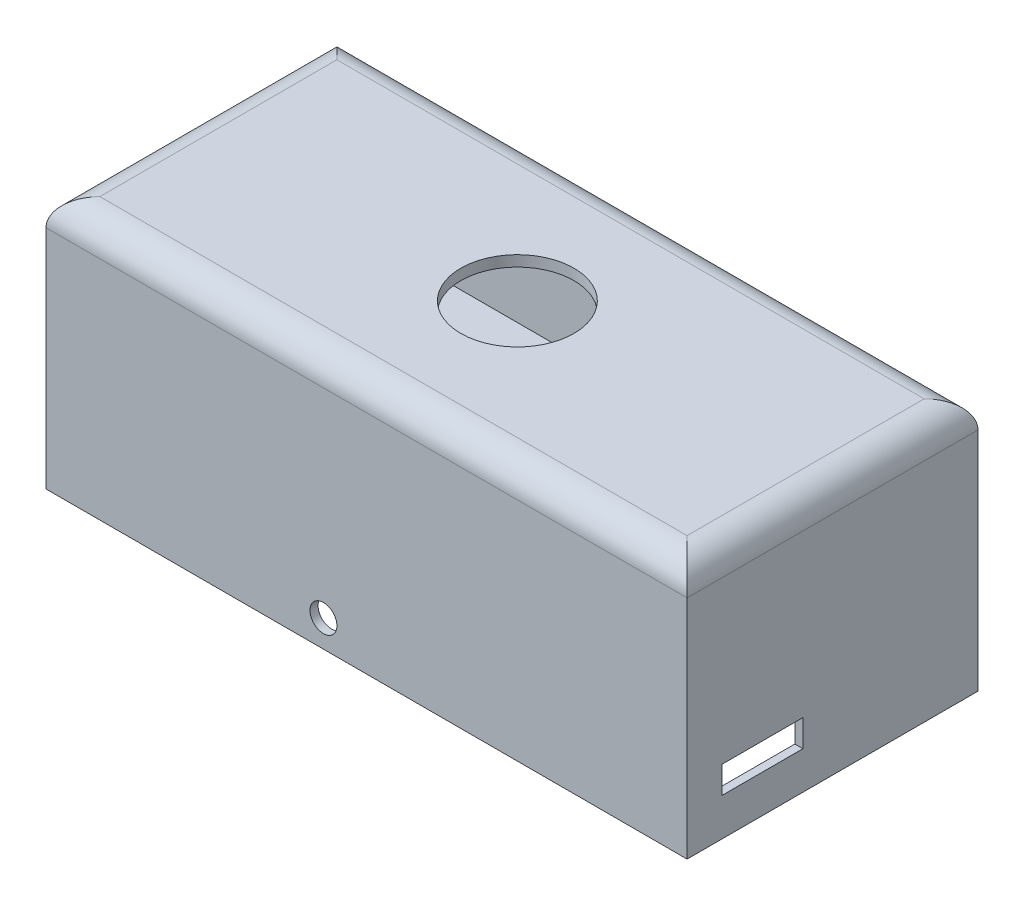
ISO-10303-21;
HEADER;
FILE_DESCRIPTION(('STEP AP214'),'2;1');
FILE_NAME('part.step','',(''),(''),'','','');
FILE_SCHEMA(('AUTOMOTIVE_DESIGN { 1 0 10303 214 1 1 1 1 }'));
ENDSEC;
DATA;
#1=APPLICATION_CONTEXT('core data for automotive mechanical design processes');
#2=APPLICATION_PROTOCOL_DEFINITION('international standard','automotive_design',2000,#1);
#3=PRODUCT_CONTEXT('',#1,'mechanical');
#4=PRODUCT('Part','Part','',(#3));
#5=PRODUCT_RELATED_PRODUCT_CATEGORY('part','',(#4));
#6=PRODUCT_DEFINITION_FORMATION('','',#4);
#7=PRODUCT_DEFINITION_CONTEXT('part definition',#1,'design');
#8=PRODUCT_DEFINITION('design','',#6,#7);
#9=PRODUCT_DEFINITION_SHAPE('','',#8);
#10=(LENGTH_UNIT() NAMED_UNIT(*) SI_UNIT(.MILLI.,.METRE.));
#11=(NAMED_UNIT(*) PLANE_ANGLE_UNIT() SI_UNIT($,.RADIAN.));
#12=(NAMED_UNIT(*) SI_UNIT($,.STERADIAN.) SOLID_ANGLE_UNIT());
#13=UNCERTAINTY_MEASURE_WITH_UNIT(LENGTH_MEASURE(1.E-05),#10,'distance_accuracy_value','');
#14=(GEOMETRIC_REPRESENTATION_CONTEXT(3) GLOBAL_UNCERTAINTY_ASSIGNED_CONTEXT((#13)) GLOBAL_UNIT_ASSIGNED_CONTEXT((#10,
#11,#12)) REPRESENTATION_CONTEXT('',''));
#15=CARTESIAN_POINT('',(0.,0.,0.));
#16=DIRECTION('',(0.,0.,1.));
#17=DIRECTION('',(1.,0.,0.));
#18=AXIS2_PLACEMENT_3D('',#15,#16,#17);
#19=CARTESIAN_POINT('',(-0.5,53.,0.5));
#20=DIRECTION('',(0.,0.,-1.));
#21=DIRECTION('',(-1.,0.,0.));
#22=AXIS2_PLACEMENT_3D('',#19,#20,#21);
#23=PLANE('',#22);
#24=CARTESIAN_POINT('',(49.5,13.,0.5));
#25=DIRECTION('',(0.,0.,-1.));
#26=DIRECTION('',(-1.,0.,0.));
#27=AXIS2_PLACEMENT_3D('',#24,#25,#26);
#28=CIRCLE('',#27,2.5);
#29=CARTESIAN_POINT('',(47.,13.,0.5));
#30=VERTEX_POINT('',#29);
#31=EDGE_CURVE('E254',#30,#30,#28,.T.);
#32=ORIENTED_EDGE('',*,*,#31,.F.);
#33=EDGE_LOOP('',(#32));
#34=FACE_BOUND('',#33,.T.);
#35=DIRECTION('',(0.,-1.,0.));
#36=VECTOR('',#35,1.);
#37=CARTESIAN_POINT('',(-0.5,53.,0.5));
#38=LINE('',#37,#36);
#39=CARTESIAN_POINT('',(-0.5,48.,0.5));
#40=VERTEX_POINT('',#39);
#41=CARTESIAN_POINT('',(-0.5,26.,0.5));
#42=VERTEX_POINT('',#41);
#43=EDGE_CURVE('E362',#40,#42,#38,.T.);
#44=ORIENTED_EDGE('',*,*,#43,.F.);
#45=DIRECTION('',(1.,0.,0.));
#46=VECTOR('',#45,1.);
#47=CARTESIAN_POINT('',(-0.5,48.,0.5));
#48=LINE('',#47,#46);
#49=CARTESIAN_POINT('',(115.5,48.,0.5));
#50=VERTEX_POINT('',#49);
#51=EDGE_CURVE('E432',#40,#50,#48,.T.);
#52=ORIENTED_EDGE('',*,*,#51,.T.);
#53=DIRECTION('',(0.,-1.,0.));
#54=VECTOR('',#53,1.);
#55=CARTESIAN_POINT('',(115.5,53.,0.5));
#56=LINE('',#55,#54);
#57=CARTESIAN_POINT('',(115.5,10.,0.5));
#58=VERTEX_POINT('',#57);
#59=EDGE_CURVE('E359',#50,#58,#56,.T.);
#60=ORIENTED_EDGE('',*,*,#59,.T.);
#61=DIRECTION('',(1.,0.,0.));
#62=VECTOR('',#61,1.);
#63=CARTESIAN_POINT('',(-0.5,10.,0.5));
#64=LINE('',#63,#62);
#65=CARTESIAN_POINT('',(-0.5,10.,0.5));
#66=VERTEX_POINT('',#65);
#67=EDGE_CURVE('E338',#66,#58,#64,.T.);
#68=ORIENTED_EDGE('',*,*,#67,.F.);
#69=CARTESIAN_POINT('',(-0.500000000000002,23.,0.5));
#70=VERTEX_POINT('',#69);
#71=EDGE_CURVE('E361',#70,#66,#38,.T.);
#72=ORIENTED_EDGE('',*,*,#71,.F.);
#73=DIRECTION('',(-1.,0.,0.));
#74=VECTOR('',#73,1.);
#75=CARTESIAN_POINT('',(-0.500000000000002,23.,0.5));
#76=LINE('',#75,#74);
#77=CARTESIAN_POINT('',(44.5,23.,0.5));
#78=VERTEX_POINT('',#77);
#79=EDGE_CURVE('E294',#78,#70,#76,.T.);
#80=ORIENTED_EDGE('',*,*,#79,.F.);
#81=DIRECTION('',(0.,-1.,0.));
#82=VECTOR('',#81,1.);
#83=CARTESIAN_POINT('',(44.5,23.,0.5));
#84=LINE('',#83,#82);
#85=CARTESIAN_POINT('',(44.5,26.,0.5));
#86=VERTEX_POINT('',#85);
#87=EDGE_CURVE('E291',#86,#78,#84,.T.);
#88=ORIENTED_EDGE('',*,*,#87,.F.);
#89=DIRECTION('',(1.,0.,0.));
#90=VECTOR('',#89,1.);
#91=CARTESIAN_POINT('',(44.5,26.,0.5));
#92=LINE('',#91,#90);
#93=EDGE_CURVE('E295',#42,#86,#92,.T.);
#94=ORIENTED_EDGE('',*,*,#93,.F.);
#95=EDGE_LOOP('',(#44,#52,#60,#68,#72,#80,#88,#94));
#96=FACE_BOUND('',#95,.T.);
#97=ADVANCED_FACE('F39',(#34,#96),#23,.T.);
#98=CARTESIAN_POINT('',(-0.5,53.,-50.5));
#99=DIRECTION('',(1.,0.,0.));
#100=DIRECTION('',(0.,0.,-1.));
#101=AXIS2_PLACEMENT_3D('',#98,#99,#100);
#102=PLANE('',#101);
#103=DIRECTION('',(0.,0.,-1.));
#104=VECTOR('',#103,1.);
#105=CARTESIAN_POINT('',(-0.5,34.,-50.5));
#106=LINE('',#105,#104);
#107=CARTESIAN_POINT('',(-0.5,34.,-13.5));
#108=VERTEX_POINT('',#107);
#109=CARTESIAN_POINT('',(-0.5,34.,-36.5));
#110=VERTEX_POINT('',#109);
#111=EDGE_CURVE('E285',#108,#110,#106,.T.);
#112=ORIENTED_EDGE('',*,*,#111,.F.);
#113=DIRECTION('',(0.,-1.,0.));
#114=VECTOR('',#113,1.);
#115=CARTESIAN_POINT('',(-0.5,53.,-13.5));
#116=LINE('',#115,#114);
#117=CARTESIAN_POINT('',(-0.5,47.,-13.5));
#118=VERTEX_POINT('',#117);
#119=EDGE_CURVE('E271',#118,#108,#116,.T.);
#120=ORIENTED_EDGE('',*,*,#119,.F.);
#121=DIRECTION('',(0.,0.,-1.));
#122=VECTOR('',#121,1.);
#123=CARTESIAN_POINT('',(-0.5,47.,-50.5));
#124=LINE('',#123,#122);
#125=CARTESIAN_POINT('',(-0.5,47.,-36.5));
#126=VERTEX_POINT('',#125);
#127=EDGE_CURVE('E279',#118,#126,#124,.T.);
#128=ORIENTED_EDGE('',*,*,#127,.T.);
#129=DIRECTION('',(0.,-1.,0.));
#130=VECTOR('',#129,1.);
#131=CARTESIAN_POINT('',(-0.5,53.,-36.5));
#132=LINE('',#131,#130);
#133=EDGE_CURVE('E282',#126,#110,#132,.T.);
#134=ORIENTED_EDGE('',*,*,#133,.T.);
#135=EDGE_LOOP('',(#112,#120,#128,#134));
#136=FACE_BOUND('',#135,.T.);
#137=DIRECTION('',(0.,-1.,0.));
#138=VECTOR('',#137,1.);
#139=CARTESIAN_POINT('',(-0.5,53.,-50.5));
#140=LINE('',#139,#138);
#141=CARTESIAN_POINT('',(-0.5,48.,-50.5));
#142=VERTEX_POINT('',#141);
#143=CARTESIAN_POINT('',(-0.500000000000002,26.,-50.5));
#144=VERTEX_POINT('',#143);
#145=EDGE_CURVE('E365',#142,#144,#140,.T.);
#146=ORIENTED_EDGE('',*,*,#145,.F.);
#147=DIRECTION('',(0.,0.,1.));
#148=VECTOR('',#147,1.);
#149=CARTESIAN_POINT('',(-0.5,48.,-50.5));
#150=LINE('',#149,#148);
#151=EDGE_CURVE('E434',#142,#40,#150,.T.);
#152=ORIENTED_EDGE('',*,*,#151,.T.);
#153=ORIENTED_EDGE('',*,*,#43,.T.);
#154=DIRECTION('',(0.,0.,-1.));
#155=VECTOR('',#154,1.);
#156=CARTESIAN_POINT('',(-0.500000000000002,26.,45.5998891351187));
#157=LINE('',#156,#155);
#158=EDGE_CURVE('E308',#42,#144,#157,.T.);
#159=ORIENTED_EDGE('',*,*,#158,.T.);
#160=EDGE_LOOP('',(#146,#152,#153,#159));
#161=FACE_BOUND('',#160,.T.);
#162=ADVANCED_FACE('F473',(#136,#161),#102,.T.);
#163=CARTESIAN_POINT('',(-0.5,23.,-50.5));
#164=VERTEX_POINT('',#163);
#165=CARTESIAN_POINT('',(-0.5,10.,-50.5));
#166=VERTEX_POINT('',#165);
#167=EDGE_CURVE('E364',#164,#166,#140,.T.);
#168=ORIENTED_EDGE('',*,*,#167,.F.);
#169=DIRECTION('',(0.,0.,-1.));
#170=VECTOR('',#169,1.);
#171=CARTESIAN_POINT('',(-0.500000000000002,23.,45.5998891351187));
#172=LINE('',#171,#170);
#173=EDGE_CURVE('E315',#70,#164,#172,.T.);
#174=ORIENTED_EDGE('',*,*,#173,.F.);
#175=ORIENTED_EDGE('',*,*,#71,.T.);
#176=DIRECTION('',(0.,0.,1.));
#177=VECTOR('',#176,1.);
#178=CARTESIAN_POINT('',(-0.5,10.,-50.5));
#179=LINE('',#178,#177);
#180=EDGE_CURVE('E353',#166,#66,#179,.T.);
#181=ORIENTED_EDGE('',*,*,#180,.F.);
#182=EDGE_LOOP('',(#168,#174,#175,#181));
#183=FACE_BOUND('',#182,.T.);
#184=ADVANCED_FACE('F479',(#183),#102,.T.);
#185=CARTESIAN_POINT('',(115.5,53.,-50.5));
#186=DIRECTION('',(0.,0.,1.));
#187=DIRECTION('',(1.,0.,0.));
#188=AXIS2_PLACEMENT_3D('',#185,#186,#187);
#189=PLANE('',#188);
#190=DIRECTION('',(0.,-1.,0.));
#191=VECTOR('',#190,1.);
#192=CARTESIAN_POINT('',(115.5,53.,-50.5));
#193=LINE('',#192,#191);
#194=CARTESIAN_POINT('',(115.5,48.,-50.5));
#195=VERTEX_POINT('',#194);
#196=CARTESIAN_POINT('',(115.5,10.,-50.5));
#197=VERTEX_POINT('',#196);
#198=EDGE_CURVE('E367',#195,#197,#193,.T.);
#199=ORIENTED_EDGE('',*,*,#198,.F.);
#200=DIRECTION('',(-1.,0.,0.));
#201=VECTOR('',#200,1.);
#202=CARTESIAN_POINT('',(115.5,48.,-50.5));
#203=LINE('',#202,#201);
#204=EDGE_CURVE('E436',#195,#142,#203,.T.);
#205=ORIENTED_EDGE('',*,*,#204,.T.);
#206=ORIENTED_EDGE('',*,*,#145,.T.);
#207=DIRECTION('',(-1.,0.,0.));
#208=VECTOR('',#207,1.);
#209=CARTESIAN_POINT('',(44.5,26.,-50.5));
#210=LINE('',#209,#208);
#211=CARTESIAN_POINT('',(44.5,26.,-50.5));
#212=VERTEX_POINT('',#211);
#213=EDGE_CURVE('E305',#212,#144,#210,.T.);
#214=ORIENTED_EDGE('',*,*,#213,.F.);
#215=DIRECTION('',(0.,1.,0.));
#216=VECTOR('',#215,1.);
#217=CARTESIAN_POINT('',(44.5,23.,-50.5));
#218=LINE('',#217,#216);
#219=CARTESIAN_POINT('',(44.5,23.,-50.5));
#220=VERTEX_POINT('',#219);
#221=EDGE_CURVE('E301',#220,#212,#218,.T.);
#222=ORIENTED_EDGE('',*,*,#221,.F.);
#223=DIRECTION('',(1.,0.,0.));
#224=VECTOR('',#223,1.);
#225=CARTESIAN_POINT('',(-0.500000000000002,23.,-50.5));
#226=LINE('',#225,#224);
#227=EDGE_CURVE('E298',#164,#220,#226,.T.);
#228=ORIENTED_EDGE('',*,*,#227,.F.);
#229=ORIENTED_EDGE('',*,*,#167,.T.);
#230=DIRECTION('',(-1.,0.,0.));
#231=VECTOR('',#230,1.);
#232=CARTESIAN_POINT('',(115.5,10.,-50.5));
#233=LINE('',#232,#231);
#234=EDGE_CURVE('E356',#197,#166,#233,.T.);
#235=ORIENTED_EDGE('',*,*,#234,.F.);
#236=EDGE_LOOP('',(#199,#205,#206,#214,#222,#228,#229,#235));
#237=FACE_BOUND('',#236,.T.);
#238=ADVANCED_FACE('F487',(#237),#189,.T.);
#239=CARTESIAN_POINT('',(0.,8.,0.));
#240=DIRECTION('',(0.,1.,0.));
#241=DIRECTION('',(0.,0.,1.));
#242=AXIS2_PLACEMENT_3D('',#239,#240,#241);
#243=PLANE('',#242);
#244=DIRECTION('',(1.,0.,0.));
#245=VECTOR('',#244,1.);
#246=CARTESIAN_POINT('',(0.,8.,-51.5));
#247=LINE('',#246,#245);
#248=CARTESIAN_POINT('',(-1.5,8.,-51.5));
#249=VERTEX_POINT('',#248);
#250=CARTESIAN_POINT('',(116.5,8.,-51.5));
#251=VERTEX_POINT('',#250);
#252=EDGE_CURVE('E325',#249,#251,#247,.T.);
#253=ORIENTED_EDGE('',*,*,#252,.F.);
#254=DIRECTION('',(0.,0.,-1.));
#255=VECTOR('',#254,1.);
#256=CARTESIAN_POINT('',(-1.5,8.,0.));
#257=LINE('',#256,#255);
#258=CARTESIAN_POINT('',(-1.5,8.,1.5));
#259=VERTEX_POINT('',#258);
#260=EDGE_CURVE('E321',#259,#249,#257,.T.);
#261=ORIENTED_EDGE('',*,*,#260,.F.);
#262=DIRECTION('',(-1.,0.,0.));
#263=VECTOR('',#262,1.);
#264=CARTESIAN_POINT('',(0.,8.,1.5));
#265=LINE('',#264,#263);
#266=CARTESIAN_POINT('',(116.5,8.,1.5));
#267=VERTEX_POINT('',#266);
#268=EDGE_CURVE('E297',#267,#259,#265,.T.);
#269=ORIENTED_EDGE('',*,*,#268,.F.);
#270=DIRECTION('',(0.,0.,1.));
#271=VECTOR('',#270,1.);
#272=CARTESIAN_POINT('',(116.5,8.,0.));
#273=LINE('',#272,#271);
#274=EDGE_CURVE('E322',#251,#267,#273,.T.);
#275=ORIENTED_EDGE('',*,*,#274,.F.);
#276=EDGE_LOOP('',(#253,#261,#269,#275));
#277=FACE_BOUND('',#276,.T.);
#278=DIRECTION('',(0.,0.,1.));
#279=VECTOR('',#278,1.);
#280=CARTESIAN_POINT('',(-2.,8.,-52.));
#281=LINE('',#280,#279);
#282=CARTESIAN_POINT('',(-2.,8.,-52.));
#283=VERTEX_POINT('',#282);
#284=CARTESIAN_POINT('',(-1.99999999999999,8.,2.));
#285=VERTEX_POINT('',#284);
#286=EDGE_CURVE('E369',#283,#285,#281,.T.);
#287=ORIENTED_EDGE('',*,*,#286,.F.);
#288=DIRECTION('',(-1.,0.,0.));
#289=VECTOR('',#288,1.);
#290=CARTESIAN_POINT('',(117.,8.,-52.));
#291=LINE('',#290,#289);
#292=CARTESIAN_POINT('',(117.,8.,-52.));
#293=VERTEX_POINT('',#292);
#294=EDGE_CURVE('E378',#293,#283,#291,.T.);
#295=ORIENTED_EDGE('',*,*,#294,.F.);
#296=DIRECTION('',(0.,0.,-1.));
#297=VECTOR('',#296,1.);
#298=CARTESIAN_POINT('',(117.,8.,1.99999999999999));
#299=LINE('',#298,#297);
#300=CARTESIAN_POINT('',(117.,8.,1.99999999999999));
#301=VERTEX_POINT('',#300);
#302=EDGE_CURVE('E375',#301,#293,#299,.T.);
#303=ORIENTED_EDGE('',*,*,#302,.F.);
#304=DIRECTION('',(1.,0.,0.));
#305=VECTOR('',#304,1.);
#306=CARTESIAN_POINT('',(-1.99999999999999,8.,2.));
#307=LINE('',#306,#305);
#308=EDGE_CURVE('E372',#285,#301,#307,.T.);
#309=ORIENTED_EDGE('',*,*,#308,.F.);
#310=EDGE_LOOP('',(#287,#295,#303,#309));
#311=FACE_BOUND('',#310,.T.);
#312=ADVANCED_FACE('F490',(#277,#311),#243,.F.);
#313=CARTESIAN_POINT('',(-2.,53.,-52.));
#314=DIRECTION('',(1.,0.,0.));
#315=DIRECTION('',(0.,0.,-1.));
#316=AXIS2_PLACEMENT_3D('',#313,#314,#315);
#317=PLANE('',#316);
#318=DIRECTION('',(0.,1.,0.));
#319=VECTOR('',#318,1.);
#320=CARTESIAN_POINT('',(-2.,0.,-13.5));
#321=LINE('',#320,#319);
#322=CARTESIAN_POINT('',(-2.,34.,-13.5));
#323=VERTEX_POINT('',#322);
#324=CARTESIAN_POINT('',(-2.,47.,-13.5));
#325=VERTEX_POINT('',#324);
#326=EDGE_CURVE('E259',#323,#325,#321,.T.);
#327=ORIENTED_EDGE('',*,*,#326,.F.);
#328=DIRECTION('',(0.,0.,1.));
#329=VECTOR('',#328,1.);
#330=CARTESIAN_POINT('',(-1.99999999999999,34.,0.));
#331=LINE('',#330,#329);
#332=CARTESIAN_POINT('',(-2.,34.,-36.5));
#333=VERTEX_POINT('',#332);
#334=EDGE_CURVE('E257',#333,#323,#331,.T.);
#335=ORIENTED_EDGE('',*,*,#334,.F.);
#336=DIRECTION('',(0.,1.,0.));
#337=VECTOR('',#336,1.);
#338=CARTESIAN_POINT('',(-2.,0.,-36.5));
#339=LINE('',#338,#337);
#340=CARTESIAN_POINT('',(-2.,47.,-36.5));
#341=VERTEX_POINT('',#340);
#342=EDGE_CURVE('E265',#333,#341,#339,.T.);
#343=ORIENTED_EDGE('',*,*,#342,.T.);
#344=DIRECTION('',(0.,0.,1.));
#345=VECTOR('',#344,1.);
#346=CARTESIAN_POINT('',(-1.99999999999999,47.,0.));
#347=LINE('',#346,#345);
#348=EDGE_CURVE('E262',#341,#325,#347,.T.);
#349=ORIENTED_EDGE('',*,*,#348,.T.);
#350=EDGE_LOOP('',(#327,#335,#343,#349));
#351=FACE_BOUND('',#350,.T.);
#352=DIRECTION('',(0.,-1.,0.));
#353=VECTOR('',#352,1.);
#354=CARTESIAN_POINT('',(-1.99999999999999,53.,2.));
#355=LINE('',#354,#353);
#356=CARTESIAN_POINT('',(-1.99999999999999,50.,2.));
#357=VERTEX_POINT('',#356);
#358=EDGE_CURVE('E387',#357,#285,#355,.T.);
#359=ORIENTED_EDGE('',*,*,#358,.F.);
#360=DIRECTION('',(0.,0.,1.));
#361=VECTOR('',#360,1.);
#362=CARTESIAN_POINT('',(-2.,50.,-52.));
#363=LINE('',#362,#361);
#364=CARTESIAN_POINT('',(-2.,50.,-52.));
#365=VERTEX_POINT('',#364);
#366=EDGE_CURVE('E406',#357,#365,#363,.F.);
#367=ORIENTED_EDGE('',*,*,#366,.T.);
#368=DIRECTION('',(0.,-1.,0.));
#369=VECTOR('',#368,1.);
#370=CARTESIAN_POINT('',(-2.,53.,-52.));
#371=LINE('',#370,#369);
#372=EDGE_CURVE('E381',#365,#283,#371,.T.);
#373=ORIENTED_EDGE('',*,*,#372,.T.);
#374=ORIENTED_EDGE('',*,*,#286,.T.);
#375=EDGE_LOOP('',(#359,#367,#373,#374));
#376=FACE_BOUND('',#375,.T.);
#377=ADVANCED_FACE('F494',(#351,#376),#317,.F.);
#378=CARTESIAN_POINT('',(-1.99999999999999,53.,2.));
#379=DIRECTION('',(0.,0.,-1.));
#380=DIRECTION('',(-1.,0.,0.));
#381=AXIS2_PLACEMENT_3D('',#378,#379,#380);
#382=PLANE('',#381);
#383=CARTESIAN_POINT('',(49.5,13.,2.));
#384=DIRECTION('',(0.,0.,1.));
#385=DIRECTION('',(1.,0.,0.));
#386=AXIS2_PLACEMENT_3D('',#383,#384,#385);
#387=CIRCLE('',#386,2.5);
#388=CARTESIAN_POINT('',(52.,13.,2.));
#389=VERTEX_POINT('',#388);
#390=EDGE_CURVE('E249',#389,#389,#387,.T.);
#391=ORIENTED_EDGE('',*,*,#390,.F.);
#392=EDGE_LOOP('',(#391));
#393=FACE_BOUND('',#392,.T.);
#394=DIRECTION('',(0.,-1.,0.));
#395=VECTOR('',#394,1.);
#396=CARTESIAN_POINT('',(117.,53.,1.99999999999999));
#397=LINE('',#396,#395);
#398=CARTESIAN_POINT('',(117.,50.,1.99999999999999));
#399=VERTEX_POINT('',#398);
#400=EDGE_CURVE('E385',#399,#301,#397,.T.);
#401=ORIENTED_EDGE('',*,*,#400,.F.);
#402=DIRECTION('',(1.,0.,0.));
#403=VECTOR('',#402,1.);
#404=CARTESIAN_POINT('',(-1.99999999999999,50.,2.));
#405=LINE('',#404,#403);
#406=EDGE_CURVE('E404',#399,#357,#405,.F.);
#407=ORIENTED_EDGE('',*,*,#406,.T.);
#408=ORIENTED_EDGE('',*,*,#358,.T.);
#409=ORIENTED_EDGE('',*,*,#308,.T.);
#410=EDGE_LOOP('',(#401,#407,#408,#409));
#411=FACE_BOUND('',#410,.T.);
#412=ADVANCED_FACE('F503',(#393,#411),#382,.F.);
#413=CARTESIAN_POINT('',(117.,53.,1.99999999999999));
#414=DIRECTION('',(-1.,0.,0.));
#415=DIRECTION('',(0.,0.,1.));
#416=AXIS2_PLACEMENT_3D('',#413,#414,#415);
#417=PLANE('',#416);
#418=DIRECTION('',(0.,0.,1.));
#419=VECTOR('',#418,1.);
#420=CARTESIAN_POINT('',(117.,20.,-4.5));
#421=LINE('',#420,#419);
#422=CARTESIAN_POINT('',(117.,20.,-19.5));
#423=VERTEX_POINT('',#422);
#424=CARTESIAN_POINT('',(117.,20.,-4.5));
#425=VERTEX_POINT('',#424);
#426=EDGE_CURVE('E235',#423,#425,#421,.T.);
#427=ORIENTED_EDGE('',*,*,#426,.F.);
#428=DIRECTION('',(0.,1.,0.));
#429=VECTOR('',#428,1.);
#430=CARTESIAN_POINT('',(117.,15.,-19.5));
#431=LINE('',#430,#429);
#432=CARTESIAN_POINT('',(117.,15.,-19.5));
#433=VERTEX_POINT('',#432);
#434=EDGE_CURVE('E54',#433,#423,#431,.T.);
#435=ORIENTED_EDGE('',*,*,#434,.F.);
#436=DIRECTION('',(0.,0.,-1.));
#437=VECTOR('',#436,1.);
#438=CARTESIAN_POINT('',(117.,15.,-4.5));
#439=LINE('',#438,#437);
#440=CARTESIAN_POINT('',(117.,15.,-4.5));
#441=VERTEX_POINT('',#440);
#442=EDGE_CURVE('E242',#441,#433,#439,.T.);
#443=ORIENTED_EDGE('',*,*,#442,.F.);
#444=DIRECTION('',(0.,-1.,0.));
#445=VECTOR('',#444,1.);
#446=CARTESIAN_POINT('',(117.,15.,-4.5));
#447=LINE('',#446,#445);
#448=EDGE_CURVE('E226',#425,#441,#447,.T.);
#449=ORIENTED_EDGE('',*,*,#448,.F.);
#450=EDGE_LOOP('',(#427,#435,#443,#449));
#451=FACE_BOUND('',#450,.T.);
#452=DIRECTION('',(0.,-1.,0.));
#453=VECTOR('',#452,1.);
#454=CARTESIAN_POINT('',(117.,53.,-52.));
#455=LINE('',#454,#453);
#456=CARTESIAN_POINT('',(117.,50.,-52.));
#457=VERTEX_POINT('',#456);
#458=EDGE_CURVE('E383',#457,#293,#455,.T.);
#459=ORIENTED_EDGE('',*,*,#458,.F.);
#460=DIRECTION('',(0.,0.,-1.));
#461=VECTOR('',#460,1.);
#462=CARTESIAN_POINT('',(117.,50.,1.99999999999999));
#463=LINE('',#462,#461);
#464=EDGE_CURVE('E401',#457,#399,#463,.F.);
#465=ORIENTED_EDGE('',*,*,#464,.T.);
#466=ORIENTED_EDGE('',*,*,#400,.T.);
#467=ORIENTED_EDGE('',*,*,#302,.T.);
#468=EDGE_LOOP('',(#459,#465,#466,#467));
#469=FACE_BOUND('',#468,.T.);
#470=ADVANCED_FACE('F239',(#451,#469),#417,.F.);
#471=CARTESIAN_POINT('',(117.,53.,-52.));
#472=DIRECTION('',(0.,0.,1.));
#473=DIRECTION('',(1.,0.,0.));
#474=AXIS2_PLACEMENT_3D('',#471,#472,#473);
#475=PLANE('',#474);
#476=ORIENTED_EDGE('',*,*,#372,.F.);
#477=DIRECTION('',(-1.,0.,0.));
#478=VECTOR('',#477,1.);
#479=CARTESIAN_POINT('',(117.,50.,-52.));
#480=LINE('',#479,#478);
#481=EDGE_CURVE('E408',#365,#457,#480,.F.);
#482=ORIENTED_EDGE('',*,*,#481,.T.);
#483=ORIENTED_EDGE('',*,*,#458,.T.);
#484=ORIENTED_EDGE('',*,*,#294,.T.);
#485=EDGE_LOOP('',(#476,#482,#483,#484));
#486=FACE_BOUND('',#485,.T.);
#487=ADVANCED_FACE('F496',(#486),#475,.F.);
#488=CARTESIAN_POINT('',(0.,55.,0.));
#489=DIRECTION('',(0.,1.,0.));
#490=DIRECTION('',(0.,0.,1.));
#491=AXIS2_PLACEMENT_3D('',#488,#489,#490);
#492=PLANE('',#491);
#493=CARTESIAN_POINT('',(58.5,55.,-25.));
#494=DIRECTION('',(0.,1.,0.));
#495=DIRECTION('',(0.,0.,1.));
#496=AXIS2_PLACEMENT_3D('',#493,#494,#495);
#497=CIRCLE('',#496,10.5);
#498=CARTESIAN_POINT('',(58.5,55.,-14.5));
#499=VERTEX_POINT('',#498);
#500=EDGE_CURVE('E287',#499,#499,#497,.T.);
#501=ORIENTED_EDGE('',*,*,#500,.F.);
#502=EDGE_LOOP('',(#501));
#503=FACE_BOUND('',#502,.T.);
#504=DIRECTION('',(1.,0.,0.));
#505=VECTOR('',#504,1.);
#506=CARTESIAN_POINT('',(117.,55.,-3.00000000000001));
#507=LINE('',#506,#505);
#508=CARTESIAN_POINT('',(3.00000000000001,55.,-3.));
#509=VERTEX_POINT('',#508);
#510=CARTESIAN_POINT('',(112.,55.,-3.00000000000001));
#511=VERTEX_POINT('',#510);
#512=EDGE_CURVE('E396',#509,#511,#507,.T.);
#513=ORIENTED_EDGE('',*,*,#512,.T.);
#514=DIRECTION('',(0.,0.,-1.));
#515=VECTOR('',#514,1.);
#516=CARTESIAN_POINT('',(112.,55.,-52.));
#517=LINE('',#516,#515);
#518=CARTESIAN_POINT('',(112.,55.,-47.));
#519=VERTEX_POINT('',#518);
#520=EDGE_CURVE('E398',#511,#519,#517,.T.);
#521=ORIENTED_EDGE('',*,*,#520,.T.);
#522=DIRECTION('',(-1.,0.,0.));
#523=VECTOR('',#522,1.);
#524=CARTESIAN_POINT('',(-2.,55.,-47.));
#525=LINE('',#524,#523);
#526=CARTESIAN_POINT('',(3.,55.,-47.));
#527=VERTEX_POINT('',#526);
#528=EDGE_CURVE('E392',#519,#527,#525,.T.);
#529=ORIENTED_EDGE('',*,*,#528,.T.);
#530=DIRECTION('',(0.,0.,1.));
#531=VECTOR('',#530,1.);
#532=CARTESIAN_POINT('',(3.00000000000001,55.,2.));
#533=LINE('',#532,#531);
#534=EDGE_CURVE('E394',#527,#509,#533,.T.);
#535=ORIENTED_EDGE('',*,*,#534,.T.);
#536=EDGE_LOOP('',(#513,#521,#529,#535));
#537=FACE_BOUND('',#536,.T.);
#538=ADVANCED_FACE('F499',(#503,#537),#492,.T.);
#539=CARTESIAN_POINT('',(-1.5,8.,0.));
#540=DIRECTION('',(-0.998629534754574,0.0523359562429438,0.));
#541=DIRECTION('',(-0.0523359562429438,-0.998629534754574,0.));
#542=AXIS2_PLACEMENT_3D('',#539,#540,#541);
#543=PLANE('',#542);
#544=ORIENTED_EDGE('',*,*,#260,.T.);
#545=DIRECTION('',(-0.0522644276887139,-0.997264688634237,-0.0522644276887139));
#546=VECTOR('',#545,1.);
#547=CARTESIAN_POINT('',(-1.35932412431612,10.68425561259,-51.3593241243161));
#548=LINE('',#547,#546);
#549=CARTESIAN_POINT('',(-1.39518444143392,10.,-51.3951844414339));
#550=VERTEX_POINT('',#549);
#551=EDGE_CURVE('E332',#550,#249,#548,.T.);
#552=ORIENTED_EDGE('',*,*,#551,.F.);
#553=DIRECTION('',(0.,0.,-1.));
#554=VECTOR('',#553,1.);
#555=CARTESIAN_POINT('',(-1.39518444143392,10.,0.));
#556=LINE('',#555,#554);
#557=CARTESIAN_POINT('',(-1.39518444143392,10.,1.39518444143392));
#558=VERTEX_POINT('',#557);
#559=EDGE_CURVE('E346',#558,#550,#556,.T.);
#560=ORIENTED_EDGE('',*,*,#559,.F.);
#561=DIRECTION('',(-0.0522644276887139,-0.997264688634237,0.0522644276887139));
#562=VECTOR('',#561,1.);
#563=CARTESIAN_POINT('',(-1.49590264439756,8.07818220230845,1.49590264439756));
#564=LINE('',#563,#562);
#565=EDGE_CURVE('E336',#558,#259,#564,.T.);
#566=ORIENTED_EDGE('',*,*,#565,.T.);
#567=EDGE_LOOP('',(#544,#552,#560,#566));
#568=FACE_BOUND('',#567,.T.);
#569=ADVANCED_FACE('F602',(#568),#543,.F.);
#570=CARTESIAN_POINT('',(0.,8.,-51.5));
#571=DIRECTION('',(0.,0.0523359562429438,-0.998629534754574));
#572=DIRECTION('',(0.,0.998629534754574,0.0523359562429438));
#573=AXIS2_PLACEMENT_3D('',#570,#571,#572);
#574=PLANE('',#573);
#575=ORIENTED_EDGE('',*,*,#252,.T.);
#576=DIRECTION('',(0.0522644276887139,-0.997264688634237,-0.0522644276887139));
#577=VECTOR('',#576,1.);
#578=CARTESIAN_POINT('',(116.18177204821,14.0721510459561,-51.1817720482102));
#579=LINE('',#578,#577);
#580=CARTESIAN_POINT('',(116.395184441434,10.,-51.3951844414339));
#581=VERTEX_POINT('',#580);
#582=EDGE_CURVE('E330',#581,#251,#579,.T.);
#583=ORIENTED_EDGE('',*,*,#582,.F.);
#584=DIRECTION('',(1.,0.,0.));
#585=VECTOR('',#584,1.);
#586=CARTESIAN_POINT('',(0.,10.,-51.3951844414339));
#587=LINE('',#586,#585);
#588=EDGE_CURVE('E343',#550,#581,#587,.T.);
#589=ORIENTED_EDGE('',*,*,#588,.F.);
#590=ORIENTED_EDGE('',*,*,#551,.T.);
#591=EDGE_LOOP('',(#575,#583,#589,#590));
#592=FACE_BOUND('',#591,.T.);
#593=ADVANCED_FACE('F598',(#592),#574,.F.);
#594=CARTESIAN_POINT('',(116.5,8.,0.));
#595=DIRECTION('',(0.998629534754574,0.0523359562429438,0.));
#596=DIRECTION('',(-0.0523359562429438,0.998629534754574,0.));
#597=AXIS2_PLACEMENT_3D('',#594,#595,#596);
#598=PLANE('',#597);
#599=ORIENTED_EDGE('',*,*,#274,.T.);
#600=DIRECTION('',(0.0522644276887139,-0.997264688634237,0.0522644276887139));
#601=VECTOR('',#600,1.);
#602=CARTESIAN_POINT('',(116.495902644398,8.07818220230845,1.49590264439756));
#603=LINE('',#602,#601);
#604=CARTESIAN_POINT('',(116.395184441434,10.,1.39518444143392));
#605=VERTEX_POINT('',#604);
#606=EDGE_CURVE('E333',#605,#267,#603,.T.);
#607=ORIENTED_EDGE('',*,*,#606,.F.);
#608=DIRECTION('',(0.,0.,1.));
#609=VECTOR('',#608,1.);
#610=CARTESIAN_POINT('',(116.395184441434,10.,0.));
#611=LINE('',#610,#609);
#612=EDGE_CURVE('E340',#581,#605,#611,.T.);
#613=ORIENTED_EDGE('',*,*,#612,.F.);
#614=ORIENTED_EDGE('',*,*,#582,.T.);
#615=EDGE_LOOP('',(#599,#607,#613,#614));
#616=FACE_BOUND('',#615,.T.);
#617=ADVANCED_FACE('F595',(#616),#598,.F.);
#618=CARTESIAN_POINT('',(0.,8.,1.5));
#619=DIRECTION('',(0.,0.0523359562429438,0.998629534754574));
#620=DIRECTION('',(0.,-0.998629534754574,0.0523359562429438));
#621=AXIS2_PLACEMENT_3D('',#618,#619,#620);
#622=PLANE('',#621);
#623=ORIENTED_EDGE('',*,*,#268,.T.);
#624=ORIENTED_EDGE('',*,*,#565,.F.);
#625=DIRECTION('',(-1.,0.,0.));
#626=VECTOR('',#625,1.);
#627=CARTESIAN_POINT('',(0.,10.,1.39518444143392));
#628=LINE('',#627,#626);
#629=EDGE_CURVE('E324',#605,#558,#628,.T.);
#630=ORIENTED_EDGE('',*,*,#629,.F.);
#631=ORIENTED_EDGE('',*,*,#606,.T.);
#632=EDGE_LOOP('',(#623,#624,#630,#631));
#633=FACE_BOUND('',#632,.T.);
#634=ADVANCED_FACE('F594',(#633),#622,.F.);
#635=CARTESIAN_POINT('',(0.,10.,0.));
#636=DIRECTION('',(0.,1.,0.));
#637=DIRECTION('',(0.,0.,1.));
#638=AXIS2_PLACEMENT_3D('',#635,#636,#637);
#639=PLANE('',#638);
#640=ORIENTED_EDGE('',*,*,#234,.T.);
#641=ORIENTED_EDGE('',*,*,#180,.T.);
#642=ORIENTED_EDGE('',*,*,#67,.T.);
#643=DIRECTION('',(0.,0.,-1.));
#644=VECTOR('',#643,1.);
#645=CARTESIAN_POINT('',(115.5,10.,-4.5));
#646=LINE('',#645,#644);
#647=EDGE_CURVE('E389',#58,#197,#646,.T.);
#648=ORIENTED_EDGE('',*,*,#647,.T.);
#649=EDGE_LOOP('',(#640,#641,#642,#648));
#650=FACE_BOUND('',#649,.T.);
#651=ORIENTED_EDGE('',*,*,#559,.T.);
#652=ORIENTED_EDGE('',*,*,#588,.T.);
#653=ORIENTED_EDGE('',*,*,#612,.T.);
#654=ORIENTED_EDGE('',*,*,#629,.T.);
#655=EDGE_LOOP('',(#651,#652,#653,#654));
#656=FACE_BOUND('',#655,.T.);
#657=ADVANCED_FACE('F565',(#650,#656),#639,.F.);
#658=CARTESIAN_POINT('',(0.,53.,0.));
#659=DIRECTION('',(0.,1.,0.));
#660=DIRECTION('',(0.,0.,1.));
#661=AXIS2_PLACEMENT_3D('',#658,#659,#660);
#662=PLANE('',#661);
#663=CARTESIAN_POINT('',(58.5,53.,-25.));
#664=DIRECTION('',(0.,1.,0.));
#665=DIRECTION('',(0.,0.,1.));
#666=AXIS2_PLACEMENT_3D('',#663,#664,#665);
#667=CIRCLE('',#666,10.5);
#668=CARTESIAN_POINT('',(58.5,53.,-14.5));
#669=VERTEX_POINT('',#668);
#670=EDGE_CURVE('E290',#669,#669,#667,.T.);
#671=ORIENTED_EDGE('',*,*,#670,.T.);
#672=EDGE_LOOP('',(#671));
#673=FACE_BOUND('',#672,.T.);
#674=DIRECTION('',(-1.,0.,0.));
#675=VECTOR('',#674,1.);
#676=CARTESIAN_POINT('',(0.,53.,-45.5));
#677=LINE('',#676,#675);
#678=CARTESIAN_POINT('',(4.5,53.,-45.5));
#679=VERTEX_POINT('',#678);
#680=CARTESIAN_POINT('',(110.5,53.,-45.5));
#681=VERTEX_POINT('',#680);
#682=EDGE_CURVE('E423',#679,#681,#677,.F.);
#683=ORIENTED_EDGE('',*,*,#682,.T.);
#684=DIRECTION('',(0.,0.,-1.));
#685=VECTOR('',#684,1.);
#686=CARTESIAN_POINT('',(110.5,53.,0.));
#687=LINE('',#686,#685);
#688=CARTESIAN_POINT('',(110.5,53.,-4.5));
#689=VERTEX_POINT('',#688);
#690=EDGE_CURVE('E429',#681,#689,#687,.F.);
#691=ORIENTED_EDGE('',*,*,#690,.T.);
#692=DIRECTION('',(1.,0.,0.));
#693=VECTOR('',#692,1.);
#694=CARTESIAN_POINT('',(0.,53.,-4.5));
#695=LINE('',#694,#693);
#696=CARTESIAN_POINT('',(4.5,53.,-4.5));
#697=VERTEX_POINT('',#696);
#698=EDGE_CURVE('E427',#689,#697,#695,.F.);
#699=ORIENTED_EDGE('',*,*,#698,.T.);
#700=DIRECTION('',(0.,0.,1.));
#701=VECTOR('',#700,1.);
#702=CARTESIAN_POINT('',(4.5,53.,0.));
#703=LINE('',#702,#701);
#704=EDGE_CURVE('E425',#697,#679,#703,.F.);
#705=ORIENTED_EDGE('',*,*,#704,.T.);
#706=EDGE_LOOP('',(#683,#691,#699,#705));
#707=FACE_BOUND('',#706,.T.);
#708=ADVANCED_FACE('F551',(#673,#707),#662,.F.);
#709=CARTESIAN_POINT('',(115.5,53.,-4.5));
#710=DIRECTION('',(-1.,0.,0.));
#711=DIRECTION('',(0.,0.,1.));
#712=AXIS2_PLACEMENT_3D('',#709,#710,#711);
#713=PLANE('',#712);
#714=DIRECTION('',(0.,-1.,0.));
#715=VECTOR('',#714,1.);
#716=CARTESIAN_POINT('',(115.5,53.,-19.5));
#717=LINE('',#716,#715);
#718=CARTESIAN_POINT('',(115.5,20.,-19.5));
#719=VERTEX_POINT('',#718);
#720=CARTESIAN_POINT('',(115.5,15.,-19.5));
#721=VERTEX_POINT('',#720);
#722=EDGE_CURVE('E12',#719,#721,#717,.T.);
#723=ORIENTED_EDGE('',*,*,#722,.F.);
#724=DIRECTION('',(0.,0.,-1.));
#725=VECTOR('',#724,1.);
#726=CARTESIAN_POINT('',(115.5,20.,-4.5));
#727=LINE('',#726,#725);
#728=CARTESIAN_POINT('',(115.5,20.,-4.5));
#729=VERTEX_POINT('',#728);
#730=EDGE_CURVE('E438',#729,#719,#727,.T.);
#731=ORIENTED_EDGE('',*,*,#730,.F.);
#732=DIRECTION('',(0.,1.,0.));
#733=VECTOR('',#732,1.);
#734=CARTESIAN_POINT('',(115.5,53.,-4.5));
#735=LINE('',#734,#733);
#736=CARTESIAN_POINT('',(115.5,15.,-4.5));
#737=VERTEX_POINT('',#736);
#738=EDGE_CURVE('E229',#737,#729,#735,.T.);
#739=ORIENTED_EDGE('',*,*,#738,.F.);
#740=DIRECTION('',(0.,0.,1.));
#741=VECTOR('',#740,1.);
#742=CARTESIAN_POINT('',(115.5,15.,-4.5));
#743=LINE('',#742,#741);
#744=EDGE_CURVE('E47',#721,#737,#743,.T.);
#745=ORIENTED_EDGE('',*,*,#744,.F.);
#746=EDGE_LOOP('',(#723,#731,#739,#745));
#747=FACE_BOUND('',#746,.T.);
#748=ORIENTED_EDGE('',*,*,#59,.F.);
#749=DIRECTION('',(0.,0.,-1.));
#750=VECTOR('',#749,1.);
#751=CARTESIAN_POINT('',(115.5,48.,-4.5));
#752=LINE('',#751,#750);
#753=EDGE_CURVE('E410',#50,#195,#752,.T.);
#754=ORIENTED_EDGE('',*,*,#753,.T.);
#755=ORIENTED_EDGE('',*,*,#198,.T.);
#756=ORIENTED_EDGE('',*,*,#647,.F.);
#757=EDGE_LOOP('',(#748,#754,#755,#756));
#758=FACE_BOUND('',#757,.T.);
#759=ADVANCED_FACE('F457',(#747,#758),#713,.T.);
#760=CARTESIAN_POINT('',(44.5,26.,45.5998891351187));
#761=DIRECTION('',(0.,-1.,0.));
#762=DIRECTION('',(1.,0.,0.));
#763=AXIS2_PLACEMENT_3D('',#760,#761,#762);
#764=PLANE('',#763);
#765=ORIENTED_EDGE('',*,*,#158,.F.);
#766=ORIENTED_EDGE('',*,*,#93,.T.);
#767=DIRECTION('',(0.,0.,-1.));
#768=VECTOR('',#767,1.);
#769=CARTESIAN_POINT('',(44.5,26.,45.5998891351187));
#770=LINE('',#769,#768);
#771=EDGE_CURVE('E311',#86,#212,#770,.T.);
#772=ORIENTED_EDGE('',*,*,#771,.T.);
#773=ORIENTED_EDGE('',*,*,#213,.T.);
#774=EDGE_LOOP('',(#765,#766,#772,#773));
#775=FACE_BOUND('',#774,.T.);
#776=ADVANCED_FACE('F578',(#775),#764,.F.);
#777=CARTESIAN_POINT('',(44.5,23.,45.5998891351187));
#778=DIRECTION('',(-1.,0.,0.));
#779=DIRECTION('',(0.,0.,1.));
#780=AXIS2_PLACEMENT_3D('',#777,#778,#779);
#781=PLANE('',#780);
#782=ORIENTED_EDGE('',*,*,#771,.F.);
#783=ORIENTED_EDGE('',*,*,#87,.T.);
#784=DIRECTION('',(0.,0.,-1.));
#785=VECTOR('',#784,1.);
#786=CARTESIAN_POINT('',(44.5,23.,45.5998891351187));
#787=LINE('',#786,#785);
#788=EDGE_CURVE('E313',#78,#220,#787,.T.);
#789=ORIENTED_EDGE('',*,*,#788,.T.);
#790=ORIENTED_EDGE('',*,*,#221,.T.);
#791=EDGE_LOOP('',(#782,#783,#789,#790));
#792=FACE_BOUND('',#791,.T.);
#793=ADVANCED_FACE('F582',(#792),#781,.F.);
#794=CARTESIAN_POINT('',(-0.500000000000002,23.,45.5998891351187));
#795=DIRECTION('',(0.,1.,0.));
#796=DIRECTION('',(0.,0.,1.));
#797=AXIS2_PLACEMENT_3D('',#794,#795,#796);
#798=PLANE('',#797);
#799=ORIENTED_EDGE('',*,*,#788,.F.);
#800=ORIENTED_EDGE('',*,*,#79,.T.);
#801=ORIENTED_EDGE('',*,*,#173,.T.);
#802=ORIENTED_EDGE('',*,*,#227,.T.);
#803=EDGE_LOOP('',(#799,#800,#801,#802));
#804=FACE_BOUND('',#803,.T.);
#805=ADVANCED_FACE('F525',(#804),#798,.F.);
#806=CARTESIAN_POINT('',(3.00000000000001,50.,0.));
#807=DIRECTION('',(0.,0.,-1.));
#808=DIRECTION('',(-1.,0.,0.));
#809=AXIS2_PLACEMENT_3D('',#806,#807,#808);
#810=CYLINDRICAL_SURFACE('',#809,5.);
#811=CARTESIAN_POINT('',(3.,50.,-47.));
#812=DIRECTION('',(0.707106781186547,0.,-0.707106781186548));
#813=DIRECTION('',(0.707106781186548,0.,0.707106781186547));
#814=AXIS2_PLACEMENT_3D('',#811,#812,#813);
#815=ELLIPSE('',#814,7.07106781186547,5.);
#816=EDGE_CURVE('E416',#365,#527,#815,.T.);
#817=ORIENTED_EDGE('',*,*,#816,.F.);
#818=ORIENTED_EDGE('',*,*,#366,.F.);
#819=CARTESIAN_POINT('',(3.,50.,-3.));
#820=DIRECTION('',(-0.707106781186548,0.,-0.707106781186547));
#821=DIRECTION('',(0.707106781186547,0.,-0.707106781186548));
#822=AXIS2_PLACEMENT_3D('',#819,#820,#821);
#823=ELLIPSE('',#822,7.07106781186547,5.);
#824=EDGE_CURVE('E302',#509,#357,#823,.F.);
#825=ORIENTED_EDGE('',*,*,#824,.F.);
#826=ORIENTED_EDGE('',*,*,#534,.F.);
#827=EDGE_LOOP('',(#817,#818,#825,#826));
#828=FACE_BOUND('',#827,.T.);
#829=ADVANCED_FACE('F521',(#828),#810,.T.);
#830=CARTESIAN_POINT('',(0.,50.,-3.));
#831=DIRECTION('',(-1.,0.,0.));
#832=DIRECTION('',(0.,0.,1.));
#833=AXIS2_PLACEMENT_3D('',#830,#831,#832);
#834=CYLINDRICAL_SURFACE('',#833,5.);
#835=ORIENTED_EDGE('',*,*,#824,.T.);
#836=ORIENTED_EDGE('',*,*,#406,.F.);
#837=CARTESIAN_POINT('',(112.,50.,-3.00000000000001));
#838=DIRECTION('',(-0.707106781186547,0.,0.707106781186547));
#839=DIRECTION('',(-0.707106781186548,0.,-0.707106781186547));
#840=AXIS2_PLACEMENT_3D('',#837,#838,#839);
#841=ELLIPSE('',#840,7.07106781186547,5.);
#842=EDGE_CURVE('E413',#511,#399,#841,.F.);
#843=ORIENTED_EDGE('',*,*,#842,.F.);
#844=ORIENTED_EDGE('',*,*,#512,.F.);
#845=EDGE_LOOP('',(#835,#836,#843,#844));
#846=FACE_BOUND('',#845,.T.);
#847=ADVANCED_FACE('F517',(#846),#834,.T.);
#848=CARTESIAN_POINT('',(0.,50.,-47.));
#849=DIRECTION('',(1.,0.,0.));
#850=DIRECTION('',(0.,0.,-1.));
#851=AXIS2_PLACEMENT_3D('',#848,#849,#850);
#852=CYLINDRICAL_SURFACE('',#851,5.);
#853=ORIENTED_EDGE('',*,*,#816,.T.);
#854=ORIENTED_EDGE('',*,*,#528,.F.);
#855=CARTESIAN_POINT('',(112.,50.,-47.));
#856=DIRECTION('',(0.707106781186548,0.,0.707106781186547));
#857=DIRECTION('',(0.707106781186547,0.,-0.707106781186548));
#858=AXIS2_PLACEMENT_3D('',#855,#856,#857);
#859=ELLIPSE('',#858,7.07106781186548,5.);
#860=EDGE_CURVE('E411',#457,#519,#859,.T.);
#861=ORIENTED_EDGE('',*,*,#860,.F.);
#862=ORIENTED_EDGE('',*,*,#481,.F.);
#863=EDGE_LOOP('',(#853,#854,#861,#862));
#864=FACE_BOUND('',#863,.T.);
#865=ADVANCED_FACE('F513',(#864),#852,.T.);
#866=CARTESIAN_POINT('',(112.,50.,0.));
#867=DIRECTION('',(0.,0.,1.));
#868=DIRECTION('',(1.,0.,0.));
#869=AXIS2_PLACEMENT_3D('',#866,#867,#868);
#870=CYLINDRICAL_SURFACE('',#869,5.);
#871=ORIENTED_EDGE('',*,*,#842,.T.);
#872=ORIENTED_EDGE('',*,*,#464,.F.);
#873=ORIENTED_EDGE('',*,*,#860,.T.);
#874=ORIENTED_EDGE('',*,*,#520,.F.);
#875=EDGE_LOOP('',(#871,#872,#873,#874));
#876=FACE_BOUND('',#875,.T.);
#877=ADVANCED_FACE('F510',(#876),#870,.T.);
#878=CARTESIAN_POINT('',(4.5,48.,-50.5));
#879=DIRECTION('',(0.,0.,1.));
#880=DIRECTION('',(1.,0.,0.));
#881=AXIS2_PLACEMENT_3D('',#878,#879,#880);
#882=CYLINDRICAL_SURFACE('',#881,5.);
#883=CARTESIAN_POINT('',(4.5,48.,-45.5));
#884=DIRECTION('',(-0.707106781186547,0.,0.707106781186547));
#885=DIRECTION('',(0.707106781186547,0.,0.707106781186547));
#886=AXIS2_PLACEMENT_3D('',#883,#884,#885);
#887=ELLIPSE('',#886,7.07106781186547,5.);
#888=EDGE_CURVE('E443',#679,#142,#887,.T.);
#889=ORIENTED_EDGE('',*,*,#888,.F.);
#890=ORIENTED_EDGE('',*,*,#704,.F.);
#891=CARTESIAN_POINT('',(4.5,48.,-4.5));
#892=DIRECTION('',(0.707106781186547,0.,0.707106781186547));
#893=DIRECTION('',(0.707106781186547,0.,-0.707106781186547));
#894=AXIS2_PLACEMENT_3D('',#891,#892,#893);
#895=ELLIPSE('',#894,7.07106781186547,5.);
#896=EDGE_CURVE('E414',#40,#697,#895,.F.);
#897=ORIENTED_EDGE('',*,*,#896,.F.);
#898=ORIENTED_EDGE('',*,*,#151,.F.);
#899=EDGE_LOOP('',(#889,#890,#897,#898));
#900=FACE_BOUND('',#899,.T.);
#901=ADVANCED_FACE('F41',(#900),#882,.F.);
#902=CARTESIAN_POINT('',(-0.5,48.,-4.5));
#903=DIRECTION('',(1.,0.,0.));
#904=DIRECTION('',(0.,0.,-1.));
#905=AXIS2_PLACEMENT_3D('',#902,#903,#904);
#906=CYLINDRICAL_SURFACE('',#905,5.);
#907=ORIENTED_EDGE('',*,*,#896,.T.);
#908=ORIENTED_EDGE('',*,*,#698,.F.);
#909=CARTESIAN_POINT('',(110.5,48.,-4.5));
#910=DIRECTION('',(0.707106781186547,0.,-0.707106781186547));
#911=DIRECTION('',(-0.707106781186547,0.,-0.707106781186547));
#912=AXIS2_PLACEMENT_3D('',#909,#910,#911);
#913=ELLIPSE('',#912,7.07106781186547,5.);
#914=EDGE_CURVE('E441',#50,#689,#913,.F.);
#915=ORIENTED_EDGE('',*,*,#914,.F.);
#916=ORIENTED_EDGE('',*,*,#51,.F.);
#917=EDGE_LOOP('',(#907,#908,#915,#916));
#918=FACE_BOUND('',#917,.T.);
#919=ADVANCED_FACE('F534',(#918),#906,.F.);
#920=CARTESIAN_POINT('',(115.5,48.,-45.5));
#921=DIRECTION('',(-1.,0.,0.));
#922=DIRECTION('',(0.,0.,1.));
#923=AXIS2_PLACEMENT_3D('',#920,#921,#922);
#924=CYLINDRICAL_SURFACE('',#923,5.);
#925=ORIENTED_EDGE('',*,*,#888,.T.);
#926=ORIENTED_EDGE('',*,*,#204,.F.);
#927=CARTESIAN_POINT('',(110.5,48.,-45.5));
#928=DIRECTION('',(-0.707106781186547,0.,-0.707106781186547));
#929=DIRECTION('',(0.707106781186547,0.,-0.707106781186547));
#930=AXIS2_PLACEMENT_3D('',#927,#928,#929);
#931=ELLIPSE('',#930,7.07106781186547,5.);
#932=EDGE_CURVE('E439',#681,#195,#931,.T.);
#933=ORIENTED_EDGE('',*,*,#932,.F.);
#934=ORIENTED_EDGE('',*,*,#682,.F.);
#935=EDGE_LOOP('',(#925,#926,#933,#934));
#936=FACE_BOUND('',#935,.T.);
#937=ADVANCED_FACE('F531',(#936),#924,.F.);
#938=CARTESIAN_POINT('',(110.5,48.,-4.5));
#939=DIRECTION('',(0.,0.,-1.));
#940=DIRECTION('',(-1.,0.,0.));
#941=AXIS2_PLACEMENT_3D('',#938,#939,#940);
#942=CYLINDRICAL_SURFACE('',#941,5.);
#943=ORIENTED_EDGE('',*,*,#914,.T.);
#944=ORIENTED_EDGE('',*,*,#690,.F.);
#945=ORIENTED_EDGE('',*,*,#932,.T.);
#946=ORIENTED_EDGE('',*,*,#753,.F.);
#947=EDGE_LOOP('',(#943,#944,#945,#946));
#948=FACE_BOUND('',#947,.T.);
#949=ADVANCED_FACE('F527',(#948),#942,.F.);
#950=CARTESIAN_POINT('',(58.5,50.,-25.));
#951=DIRECTION('',(0.,1.,0.));
#952=DIRECTION('',(0.,0.,1.));
#953=AXIS2_PLACEMENT_3D('',#950,#951,#952);
#954=CYLINDRICAL_SURFACE('',#953,10.5);
#955=ORIENTED_EDGE('',*,*,#500,.T.);
#956=EDGE_LOOP('',(#955));
#957=FACE_BOUND('',#956,.T.);
#958=ORIENTED_EDGE('',*,*,#670,.F.);
#959=EDGE_LOOP('',(#958));
#960=FACE_BOUND('',#959,.T.);
#961=ADVANCED_FACE('F530',(#957,#960),#954,.F.);
#962=CARTESIAN_POINT('',(3.00000000000001,34.,0.));
#963=DIRECTION('',(0.,-1.,0.));
#964=DIRECTION('',(0.,0.,-1.));
#965=AXIS2_PLACEMENT_3D('',#962,#963,#964);
#966=PLANE('',#965);
#967=ORIENTED_EDGE('',*,*,#111,.T.);
#968=DIRECTION('',(-1.,0.,0.));
#969=VECTOR('',#968,1.);
#970=CARTESIAN_POINT('',(3.,34.,-36.5));
#971=LINE('',#970,#969);
#972=EDGE_CURVE('E269',#110,#333,#971,.T.);
#973=ORIENTED_EDGE('',*,*,#972,.T.);
#974=ORIENTED_EDGE('',*,*,#334,.T.);
#975=DIRECTION('',(-1.,0.,0.));
#976=VECTOR('',#975,1.);
#977=CARTESIAN_POINT('',(3.,34.,-13.5));
#978=LINE('',#977,#976);
#979=EDGE_CURVE('E268',#108,#323,#978,.T.);
#980=ORIENTED_EDGE('',*,*,#979,.F.);
#981=EDGE_LOOP('',(#967,#973,#974,#980));
#982=FACE_BOUND('',#981,.T.);
#983=ADVANCED_FACE('F620',(#982),#966,.F.);
#984=CARTESIAN_POINT('',(3.,0.,-36.5));
#985=DIRECTION('',(0.,0.,1.));
#986=DIRECTION('',(1.,0.,0.));
#987=AXIS2_PLACEMENT_3D('',#984,#985,#986);
#988=PLANE('',#987);
#989=DIRECTION('',(-1.,0.,0.));
#990=VECTOR('',#989,1.);
#991=CARTESIAN_POINT('',(3.,47.,-36.5));
#992=LINE('',#991,#990);
#993=EDGE_CURVE('E272',#126,#341,#992,.T.);
#994=ORIENTED_EDGE('',*,*,#993,.T.);
#995=ORIENTED_EDGE('',*,*,#342,.F.);
#996=ORIENTED_EDGE('',*,*,#972,.F.);
#997=ORIENTED_EDGE('',*,*,#133,.F.);
#998=EDGE_LOOP('',(#994,#995,#996,#997));
#999=FACE_BOUND('',#998,.T.);
#1000=ADVANCED_FACE('F626',(#999),#988,.T.);
#1001=CARTESIAN_POINT('',(3.00000000000001,47.,0.));
#1002=DIRECTION('',(0.,-1.,0.));
#1003=DIRECTION('',(0.,0.,-1.));
#1004=AXIS2_PLACEMENT_3D('',#1001,#1002,#1003);
#1005=PLANE('',#1004);
#1006=DIRECTION('',(-1.,0.,0.));
#1007=VECTOR('',#1006,1.);
#1008=CARTESIAN_POINT('',(3.,47.,-13.5));
#1009=LINE('',#1008,#1007);
#1010=EDGE_CURVE('E274',#118,#325,#1009,.T.);
#1011=ORIENTED_EDGE('',*,*,#1010,.T.);
#1012=ORIENTED_EDGE('',*,*,#348,.F.);
#1013=ORIENTED_EDGE('',*,*,#993,.F.);
#1014=ORIENTED_EDGE('',*,*,#127,.F.);
#1015=EDGE_LOOP('',(#1011,#1012,#1013,#1014));
#1016=FACE_BOUND('',#1015,.T.);
#1017=ADVANCED_FACE('F716',(#1016),#1005,.T.);
#1018=CARTESIAN_POINT('',(3.,0.,-13.5));
#1019=DIRECTION('',(0.,0.,1.));
#1020=DIRECTION('',(0.,-1.,0.));
#1021=AXIS2_PLACEMENT_3D('',#1018,#1019,#1020);
#1022=PLANE('',#1021);
#1023=ORIENTED_EDGE('',*,*,#119,.T.);
#1024=ORIENTED_EDGE('',*,*,#979,.T.);
#1025=ORIENTED_EDGE('',*,*,#326,.T.);
#1026=ORIENTED_EDGE('',*,*,#1010,.F.);
#1027=EDGE_LOOP('',(#1023,#1024,#1025,#1026));
#1028=FACE_BOUND('',#1027,.T.);
#1029=ADVANCED_FACE('F468',(#1028),#1022,.F.);
#1030=CARTESIAN_POINT('',(49.5,13.,-3.));
#1031=DIRECTION('',(0.,0.,1.));
#1032=DIRECTION('',(1.,0.,0.));
#1033=AXIS2_PLACEMENT_3D('',#1030,#1031,#1032);
#1034=CYLINDRICAL_SURFACE('',#1033,2.5);
#1035=ORIENTED_EDGE('',*,*,#31,.T.);
#1036=EDGE_LOOP('',(#1035));
#1037=FACE_BOUND('',#1036,.T.);
#1038=ORIENTED_EDGE('',*,*,#390,.T.);
#1039=EDGE_LOOP('',(#1038));
#1040=FACE_BOUND('',#1039,.T.);
#1041=ADVANCED_FACE('F461',(#1037,#1040),#1034,.F.);
#1042=CARTESIAN_POINT('',(112.,15.,-19.5));
#1043=DIRECTION('',(0.,0.,-1.));
#1044=DIRECTION('',(-1.,0.,0.));
#1045=AXIS2_PLACEMENT_3D('',#1042,#1043,#1044);
#1046=PLANE('',#1045);
#1047=ORIENTED_EDGE('',*,*,#722,.T.);
#1048=DIRECTION('',(1.,0.,0.));
#1049=VECTOR('',#1048,1.);
#1050=CARTESIAN_POINT('',(112.,15.,-19.5));
#1051=LINE('',#1050,#1049);
#1052=EDGE_CURVE('E247',#721,#433,#1051,.T.);
#1053=ORIENTED_EDGE('',*,*,#1052,.T.);
#1054=ORIENTED_EDGE('',*,*,#434,.T.);
#1055=DIRECTION('',(1.,0.,0.));
#1056=VECTOR('',#1055,1.);
#1057=CARTESIAN_POINT('',(112.,20.,-19.5));
#1058=LINE('',#1057,#1056);
#1059=EDGE_CURVE('E232',#719,#423,#1058,.T.);
#1060=ORIENTED_EDGE('',*,*,#1059,.F.);
#1061=EDGE_LOOP('',(#1047,#1053,#1054,#1060));
#1062=FACE_BOUND('',#1061,.T.);
#1063=ADVANCED_FACE('F459',(#1062),#1046,.F.);
#1064=CARTESIAN_POINT('',(112.,15.,-4.5));
#1065=DIRECTION('',(0.,-1.,0.));
#1066=DIRECTION('',(0.,0.,-1.));
#1067=AXIS2_PLACEMENT_3D('',#1064,#1065,#1066);
#1068=PLANE('',#1067);
#1069=ORIENTED_EDGE('',*,*,#744,.T.);
#1070=DIRECTION('',(1.,0.,0.));
#1071=VECTOR('',#1070,1.);
#1072=CARTESIAN_POINT('',(112.,15.,-4.5));
#1073=LINE('',#1072,#1071);
#1074=EDGE_CURVE('E231',#737,#441,#1073,.T.);
#1075=ORIENTED_EDGE('',*,*,#1074,.T.);
#1076=ORIENTED_EDGE('',*,*,#442,.T.);
#1077=ORIENTED_EDGE('',*,*,#1052,.F.);
#1078=EDGE_LOOP('',(#1069,#1075,#1076,#1077));
#1079=FACE_BOUND('',#1078,.T.);
#1080=ADVANCED_FACE('F454',(#1079),#1068,.F.);
#1081=CARTESIAN_POINT('',(112.,15.,-4.5));
#1082=DIRECTION('',(0.,0.,1.));
#1083=DIRECTION('',(1.,0.,0.));
#1084=AXIS2_PLACEMENT_3D('',#1081,#1082,#1083);
#1085=PLANE('',#1084);
#1086=ORIENTED_EDGE('',*,*,#738,.T.);
#1087=DIRECTION('',(1.,0.,0.));
#1088=VECTOR('',#1087,1.);
#1089=CARTESIAN_POINT('',(112.,20.,-4.5));
#1090=LINE('',#1089,#1088);
#1091=EDGE_CURVE('E62',#729,#425,#1090,.T.);
#1092=ORIENTED_EDGE('',*,*,#1091,.T.);
#1093=ORIENTED_EDGE('',*,*,#448,.T.);
#1094=ORIENTED_EDGE('',*,*,#1074,.F.);
#1095=EDGE_LOOP('',(#1086,#1092,#1093,#1094));
#1096=FACE_BOUND('',#1095,.T.);
#1097=ADVANCED_FACE('F223',(#1096),#1085,.F.);
#1098=CARTESIAN_POINT('',(112.,20.,-4.5));
#1099=DIRECTION('',(0.,1.,0.));
#1100=DIRECTION('',(0.,0.,1.));
#1101=AXIS2_PLACEMENT_3D('',#1098,#1099,#1100);
#1102=PLANE('',#1101);
#1103=ORIENTED_EDGE('',*,*,#730,.T.);
#1104=ORIENTED_EDGE('',*,*,#1059,.T.);
#1105=ORIENTED_EDGE('',*,*,#426,.T.);
#1106=ORIENTED_EDGE('',*,*,#1091,.F.);
#1107=EDGE_LOOP('',(#1103,#1104,#1105,#1106));
#1108=FACE_BOUND('',#1107,.T.);
#1109=ADVANCED_FACE('F236',(#1108),#1102,.F.);
#1110=CLOSED_SHELL('',(#97,#162,#184,#238,#312,#377,#412,#470,#487,#538,#569,#593,#617,#634,
#657,#708,#759,#776,#793,#805,#829,#847,#865,#877,#901,#919,#937,#949,#961,#983,#1000,#1017,
#1029,#1041,#1063,#1080,#1097,#1109));
#1111=MANIFOLD_SOLID_BREP('B2',#1110);
#1112=ADVANCED_BREP_SHAPE_REPRESENTATION('',(#18,#1111),#14);
#1113=SHAPE_DEFINITION_REPRESENTATION(#9,#1112);
ENDSEC;
END-ISO-10303-21;
